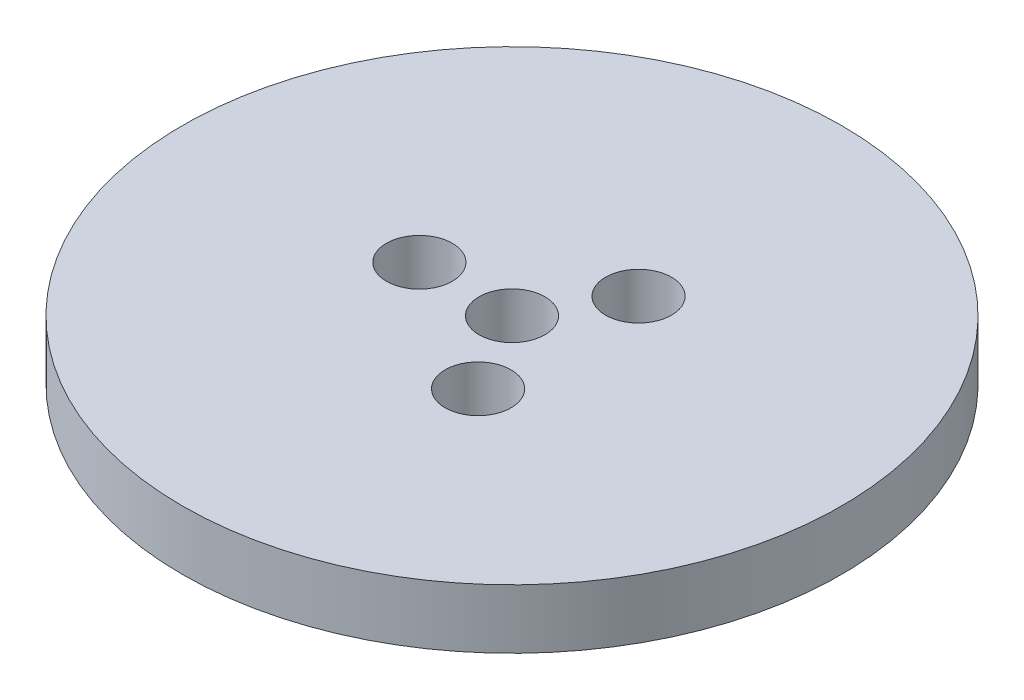
ISO-10303-21;
HEADER;
FILE_DESCRIPTION(('STEP AP214'),'2;1');
FILE_NAME('part.step','',(''),(''),'','','');
FILE_SCHEMA(('AUTOMOTIVE_DESIGN { 1 0 10303 214 1 1 1 1 }'));
ENDSEC;
DATA;
#1=APPLICATION_CONTEXT('core data for automotive mechanical design processes');
#2=APPLICATION_PROTOCOL_DEFINITION('international standard','automotive_design',2000,#1);
#3=PRODUCT_CONTEXT('',#1,'mechanical');
#4=PRODUCT('Part','Part','',(#3));
#5=PRODUCT_RELATED_PRODUCT_CATEGORY('part','',(#4));
#6=PRODUCT_DEFINITION_FORMATION('','',#4);
#7=PRODUCT_DEFINITION_CONTEXT('part definition',#1,'design');
#8=PRODUCT_DEFINITION('design','',#6,#7);
#9=PRODUCT_DEFINITION_SHAPE('','',#8);
#10=(LENGTH_UNIT() NAMED_UNIT(*) SI_UNIT(.MILLI.,.METRE.));
#11=(NAMED_UNIT(*) PLANE_ANGLE_UNIT() SI_UNIT($,.RADIAN.));
#12=(NAMED_UNIT(*) SI_UNIT($,.STERADIAN.) SOLID_ANGLE_UNIT());
#13=UNCERTAINTY_MEASURE_WITH_UNIT(LENGTH_MEASURE(1.E-05),#10,'distance_accuracy_value','');
#14=(GEOMETRIC_REPRESENTATION_CONTEXT(3) GLOBAL_UNCERTAINTY_ASSIGNED_CONTEXT((#13)) GLOBAL_UNIT_ASSIGNED_CONTEXT((#10,
#11,#12)) REPRESENTATION_CONTEXT('',''));
#15=CARTESIAN_POINT('',(0.,0.,0.));
#16=DIRECTION('',(0.,0.,1.));
#17=DIRECTION('',(1.,0.,0.));
#18=AXIS2_PLACEMENT_3D('',#15,#16,#17);
#19=CARTESIAN_POINT('',(0.,18.,0.));
#20=DIRECTION('',(0.,-1.,0.));
#21=DIRECTION('',(0.,0.,-1.));
#22=AXIS2_PLACEMENT_3D('',#19,#20,#21);
#23=CYLINDRICAL_SURFACE('',#22,100.);
#24=CARTESIAN_POINT('',(0.,18.,0.));
#25=DIRECTION('',(0.,1.,0.));
#26=DIRECTION('',(0.,0.,1.));
#27=AXIS2_PLACEMENT_3D('',#24,#25,#26);
#28=CIRCLE('',#27,100.);
#29=CARTESIAN_POINT('',(0.,18.,100.));
#30=VERTEX_POINT('',#29);
#31=EDGE_CURVE('E10',#30,#30,#28,.T.);
#32=ORIENTED_EDGE('',*,*,#31,.F.);
#33=EDGE_LOOP('',(#32));
#34=FACE_BOUND('',#33,.T.);
#35=CARTESIAN_POINT('',(0.,0.,0.));
#36=DIRECTION('',(0.,1.,0.));
#37=DIRECTION('',(0.,0.,1.));
#38=AXIS2_PLACEMENT_3D('',#35,#36,#37);
#39=CIRCLE('',#38,100.);
#40=CARTESIAN_POINT('',(0.,0.,100.));
#41=VERTEX_POINT('',#40);
#42=EDGE_CURVE('E37',#41,#41,#39,.T.);
#43=ORIENTED_EDGE('',*,*,#42,.T.);
#44=EDGE_LOOP('',(#43));
#45=FACE_BOUND('',#44,.T.);
#46=ADVANCED_FACE('F40',(#34,#45),#23,.T.);
#47=CARTESIAN_POINT('',(0.,18.,0.));
#48=DIRECTION('',(0.,1.,0.));
#49=DIRECTION('',(0.,0.,1.));
#50=AXIS2_PLACEMENT_3D('',#47,#48,#49);
#51=PLANE('',#50);
#52=CARTESIAN_POINT('',(14.0543723550659,18.,24.3428869874653));
#53=DIRECTION('',(0.,1.,0.));
#54=DIRECTION('',(0.866025403784436,0.,-0.500000000000004));
#55=AXIS2_PLACEMENT_3D('',#52,#53,#54);
#56=CIRCLE('',#55,10.);
#57=CARTESIAN_POINT('',(22.7146263929102,18.,19.3428869874652));
#58=VERTEX_POINT('',#57);
#59=EDGE_CURVE('E70',#58,#58,#56,.T.);
#60=ORIENTED_EDGE('',*,*,#59,.F.);
#61=EDGE_LOOP('',(#60));
#62=FACE_BOUND('',#61,.T.);
#63=CARTESIAN_POINT('',(14.0543723550655,18.,-24.3428869874655));
#64=DIRECTION('',(0.,1.,0.));
#65=DIRECTION('',(-0.866025403784443,0.,-0.499999999999992));
#66=AXIS2_PLACEMENT_3D('',#63,#64,#65);
#67=CIRCLE('',#66,10.);
#68=CARTESIAN_POINT('',(5.39411831722109,18.,-29.3428869874654));
#69=VERTEX_POINT('',#68);
#70=EDGE_CURVE('E61',#69,#69,#67,.T.);
#71=ORIENTED_EDGE('',*,*,#70,.F.);
#72=EDGE_LOOP('',(#71));
#73=FACE_BOUND('',#72,.T.);
#74=CARTESIAN_POINT('',(-28.1087447101315,18.,0.));
#75=DIRECTION('',(0.,1.,0.));
#76=DIRECTION('',(0.,0.,1.));
#77=AXIS2_PLACEMENT_3D('',#74,#75,#76);
#78=CIRCLE('',#77,10.);
#79=CARTESIAN_POINT('',(-28.1087447101315,18.,10.));
#80=VERTEX_POINT('',#79);
#81=EDGE_CURVE('E54',#80,#80,#78,.T.);
#82=ORIENTED_EDGE('',*,*,#81,.F.);
#83=EDGE_LOOP('',(#82));
#84=FACE_BOUND('',#83,.T.);
#85=CARTESIAN_POINT('',(0.,18.,0.));
#86=DIRECTION('',(0.,1.,0.));
#87=DIRECTION('',(0.,0.,1.));
#88=AXIS2_PLACEMENT_3D('',#85,#86,#87);
#89=CIRCLE('',#88,10.);
#90=CARTESIAN_POINT('',(0.,18.,10.));
#91=VERTEX_POINT('',#90);
#92=EDGE_CURVE('E50',#91,#91,#89,.T.);
#93=ORIENTED_EDGE('',*,*,#92,.F.);
#94=EDGE_LOOP('',(#93));
#95=FACE_BOUND('',#94,.T.);
#96=ORIENTED_EDGE('',*,*,#31,.T.);
#97=EDGE_LOOP('',(#96));
#98=FACE_BOUND('',#97,.T.);
#99=ADVANCED_FACE('F85',(#62,#73,#84,#95,#98),#51,.T.);
#100=CARTESIAN_POINT('',(0.,0.,0.));
#101=DIRECTION('',(0.,1.,0.));
#102=DIRECTION('',(0.,0.,1.));
#103=AXIS2_PLACEMENT_3D('',#100,#101,#102);
#104=PLANE('',#103);
#105=CARTESIAN_POINT('',(0.,0.,0.));
#106=DIRECTION('',(0.,1.,0.));
#107=DIRECTION('',(0.,0.,1.));
#108=AXIS2_PLACEMENT_3D('',#105,#106,#107);
#109=CIRCLE('',#108,10.);
#110=CARTESIAN_POINT('',(0.,0.,10.));
#111=VERTEX_POINT('',#110);
#112=EDGE_CURVE('E47',#111,#111,#109,.T.);
#113=ORIENTED_EDGE('',*,*,#112,.T.);
#114=EDGE_LOOP('',(#113));
#115=FACE_BOUND('',#114,.T.);
#116=ORIENTED_EDGE('',*,*,#42,.F.);
#117=EDGE_LOOP('',(#116));
#118=FACE_BOUND('',#117,.T.);
#119=ADVANCED_FACE('F84',(#115,#118),#104,.F.);
#120=CARTESIAN_POINT('',(0.,18.,0.));
#121=DIRECTION('',(0.,-1.,0.));
#122=DIRECTION('',(0.,0.,-1.));
#123=AXIS2_PLACEMENT_3D('',#120,#121,#122);
#124=CYLINDRICAL_SURFACE('',#123,10.);
#125=ORIENTED_EDGE('',*,*,#92,.T.);
#126=EDGE_LOOP('',(#125));
#127=FACE_BOUND('',#126,.T.);
#128=ORIENTED_EDGE('',*,*,#112,.F.);
#129=EDGE_LOOP('',(#128));
#130=FACE_BOUND('',#129,.T.);
#131=ADVANCED_FACE('F91',(#127,#130),#124,.F.);
#132=CARTESIAN_POINT('',(-28.1087447101315,2.91947361529853,0.));
#133=DIRECTION('',(0.,1.,0.));
#134=DIRECTION('',(0.,0.,1.));
#135=AXIS2_PLACEMENT_3D('',#132,#133,#134);
#136=CYLINDRICAL_SURFACE('',#135,10.);
#137=CARTESIAN_POINT('',(-28.1087447101315,2.91947361529853,0.));
#138=DIRECTION('',(0.,1.,0.));
#139=DIRECTION('',(0.,0.,1.));
#140=AXIS2_PLACEMENT_3D('',#137,#138,#139);
#141=CIRCLE('',#140,10.);
#142=CARTESIAN_POINT('',(-28.1087447101315,2.91947361529853,10.));
#143=VERTEX_POINT('',#142);
#144=EDGE_CURVE('E55',#143,#143,#141,.T.);
#145=ORIENTED_EDGE('',*,*,#144,.F.);
#146=EDGE_LOOP('',(#145));
#147=FACE_BOUND('',#146,.T.);
#148=ORIENTED_EDGE('',*,*,#81,.T.);
#149=EDGE_LOOP('',(#148));
#150=FACE_BOUND('',#149,.T.);
#151=ADVANCED_FACE('F96',(#147,#150),#136,.F.);
#152=CARTESIAN_POINT('',(-28.1087447101315,2.91947361529853,0.));
#153=DIRECTION('',(0.,1.,0.));
#154=DIRECTION('',(0.,0.,1.));
#155=AXIS2_PLACEMENT_3D('',#152,#153,#154);
#156=PLANE('',#155);
#157=ORIENTED_EDGE('',*,*,#144,.T.);
#158=EDGE_LOOP('',(#157));
#159=FACE_BOUND('',#158,.T.);
#160=ADVANCED_FACE('F127',(#159),#156,.T.);
#161=CARTESIAN_POINT('',(14.0543723550655,2.91947361529853,-24.3428869874655));
#162=DIRECTION('',(0.,1.,0.));
#163=DIRECTION('',(0.,0.,1.));
#164=AXIS2_PLACEMENT_3D('',#161,#162,#163);
#165=CYLINDRICAL_SURFACE('',#164,10.);
#166=CARTESIAN_POINT('',(14.0543723550655,2.91947361529853,-24.3428869874655));
#167=DIRECTION('',(0.,1.,0.));
#168=DIRECTION('',(-0.866025403784443,0.,-0.499999999999992));
#169=AXIS2_PLACEMENT_3D('',#166,#167,#168);
#170=CIRCLE('',#169,10.);
#171=CARTESIAN_POINT('',(5.39411831722109,2.91947361529853,-29.3428869874654));
#172=VERTEX_POINT('',#171);
#173=EDGE_CURVE('E63',#172,#172,#170,.T.);
#174=ORIENTED_EDGE('',*,*,#173,.F.);
#175=EDGE_LOOP('',(#174));
#176=FACE_BOUND('',#175,.T.);
#177=ORIENTED_EDGE('',*,*,#70,.T.);
#178=EDGE_LOOP('',(#177));
#179=FACE_BOUND('',#178,.T.);
#180=ADVANCED_FACE('F133',(#176,#179),#165,.F.);
#181=CARTESIAN_POINT('',(14.0543723550655,2.91947361529853,-24.3428869874655));
#182=DIRECTION('',(0.,1.,0.));
#183=DIRECTION('',(-0.866025403784443,0.,-0.499999999999992));
#184=AXIS2_PLACEMENT_3D('',#181,#182,#183);
#185=PLANE('',#184);
#186=ORIENTED_EDGE('',*,*,#173,.T.);
#187=EDGE_LOOP('',(#186));
#188=FACE_BOUND('',#187,.T.);
#189=ADVANCED_FACE('F77',(#188),#185,.T.);
#190=CARTESIAN_POINT('',(14.0543723550659,2.91947361529853,24.3428869874653));
#191=DIRECTION('',(0.,1.,0.));
#192=DIRECTION('',(0.,0.,1.));
#193=AXIS2_PLACEMENT_3D('',#190,#191,#192);
#194=CYLINDRICAL_SURFACE('',#193,10.);
#195=CARTESIAN_POINT('',(14.0543723550659,2.91947361529853,24.3428869874653));
#196=DIRECTION('',(0.,1.,0.));
#197=DIRECTION('',(0.866025403784436,0.,-0.500000000000004));
#198=AXIS2_PLACEMENT_3D('',#195,#196,#197);
#199=CIRCLE('',#198,10.);
#200=CARTESIAN_POINT('',(22.7146263929102,2.91947361529853,19.3428869874652));
#201=VERTEX_POINT('',#200);
#202=EDGE_CURVE('E59',#201,#201,#199,.T.);
#203=ORIENTED_EDGE('',*,*,#202,.F.);
#204=EDGE_LOOP('',(#203));
#205=FACE_BOUND('',#204,.T.);
#206=ORIENTED_EDGE('',*,*,#59,.T.);
#207=EDGE_LOOP('',(#206));
#208=FACE_BOUND('',#207,.T.);
#209=ADVANCED_FACE('F73',(#205,#208),#194,.F.);
#210=CARTESIAN_POINT('',(14.0543723550659,2.91947361529853,24.3428869874653));
#211=DIRECTION('',(0.,1.,0.));
#212=DIRECTION('',(0.866025403784436,0.,-0.500000000000004));
#213=AXIS2_PLACEMENT_3D('',#210,#211,#212);
#214=PLANE('',#213);
#215=ORIENTED_EDGE('',*,*,#202,.T.);
#216=EDGE_LOOP('',(#215));
#217=FACE_BOUND('',#216,.T.);
#218=ADVANCED_FACE('F71',(#217),#214,.T.);
#219=CLOSED_SHELL('',(#46,#99,#119,#131,#151,#160,#180,#189,#209,#218));
#220=MANIFOLD_SOLID_BREP('B2',#219);
#221=ADVANCED_BREP_SHAPE_REPRESENTATION('',(#18,#220),#14);
#222=SHAPE_DEFINITION_REPRESENTATION(#9,#221);
ENDSEC;
END-ISO-10303-21;
